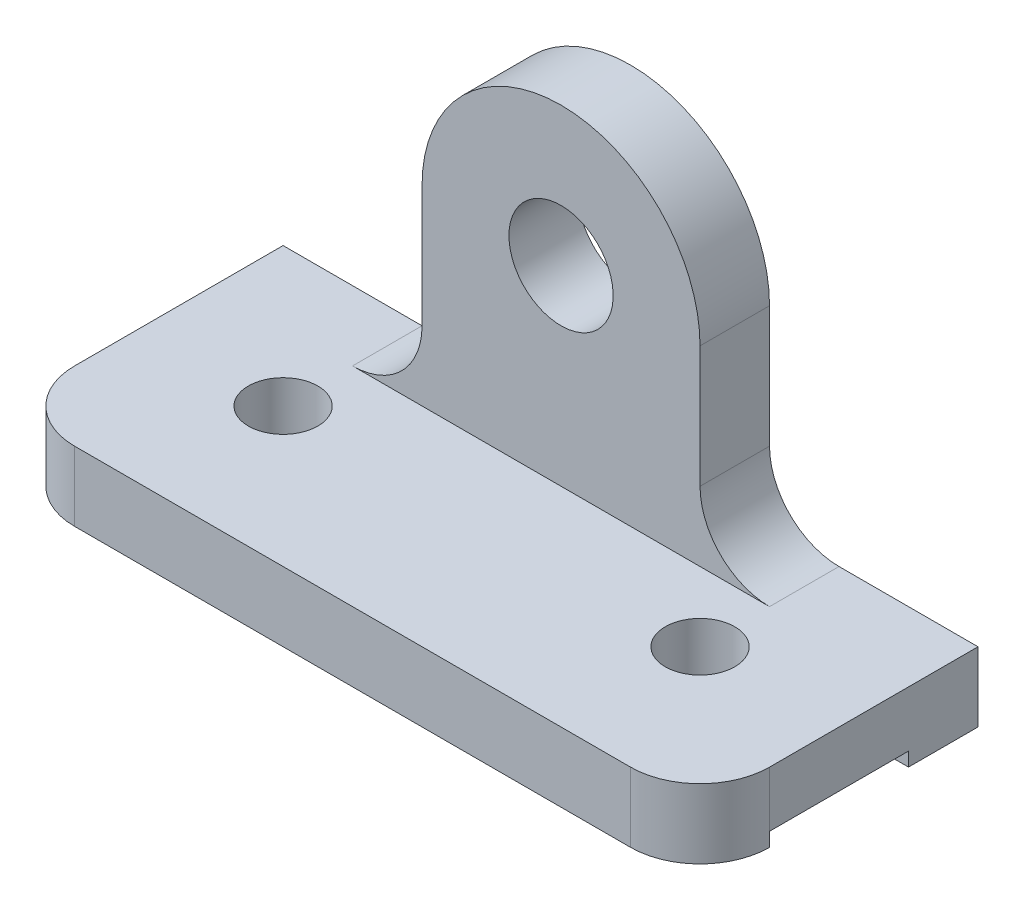
ISO-10303-21;
HEADER;
FILE_DESCRIPTION(('STEP AP214'),'2;1');
FILE_NAME('part.step','',(''),(''),'','','');
FILE_SCHEMA(('AUTOMOTIVE_DESIGN { 1 0 10303 214 1 1 1 1 }'));
ENDSEC;
DATA;
#1=APPLICATION_CONTEXT('core data for automotive mechanical design processes');
#2=APPLICATION_PROTOCOL_DEFINITION('international standard','automotive_design',2000,#1);
#3=PRODUCT_CONTEXT('',#1,'mechanical');
#4=PRODUCT('Part','Part','',(#3));
#5=PRODUCT_RELATED_PRODUCT_CATEGORY('part','',(#4));
#6=PRODUCT_DEFINITION_FORMATION('','',#4);
#7=PRODUCT_DEFINITION_CONTEXT('part definition',#1,'design');
#8=PRODUCT_DEFINITION('design','',#6,#7);
#9=PRODUCT_DEFINITION_SHAPE('','',#8);
#10=(LENGTH_UNIT() NAMED_UNIT(*) SI_UNIT(.MILLI.,.METRE.));
#11=(NAMED_UNIT(*) PLANE_ANGLE_UNIT() SI_UNIT($,.RADIAN.));
#12=(NAMED_UNIT(*) SI_UNIT($,.STERADIAN.) SOLID_ANGLE_UNIT());
#13=UNCERTAINTY_MEASURE_WITH_UNIT(LENGTH_MEASURE(1.E-05),#10,'distance_accuracy_value','');
#14=(GEOMETRIC_REPRESENTATION_CONTEXT(3) GLOBAL_UNCERTAINTY_ASSIGNED_CONTEXT((#13)) GLOBAL_UNIT_ASSIGNED_CONTEXT((#10,
#11,#12)) REPRESENTATION_CONTEXT('',''));
#15=CARTESIAN_POINT('',(0.,0.,0.));
#16=DIRECTION('',(0.,0.,1.));
#17=DIRECTION('',(1.,0.,0.));
#18=AXIS2_PLACEMENT_3D('',#15,#16,#17);
#19=CARTESIAN_POINT('',(100.,5.,20.));
#20=DIRECTION('',(0.,-1.,0.));
#21=DIRECTION('',(0.,0.,-1.));
#22=AXIS2_PLACEMENT_3D('',#19,#20,#21);
#23=PLANE('',#22);
#24=CARTESIAN_POINT('',(20.,5.,0.));
#25=DIRECTION('',(0.,1.,0.));
#26=DIRECTION('',(0.,0.,1.));
#27=AXIS2_PLACEMENT_3D('',#24,#25,#26);
#28=CIRCLE('',#27,5.);
#29=CARTESIAN_POINT('',(20.,5.,5.));
#30=VERTEX_POINT('',#29);
#31=EDGE_CURVE('E200',#30,#30,#28,.T.);
#32=ORIENTED_EDGE('',*,*,#31,.F.);
#33=EDGE_LOOP('',(#32));
#34=FACE_BOUND('',#33,.T.);
#35=CARTESIAN_POINT('',(80.,5.,0.));
#36=DIRECTION('',(0.,1.,0.));
#37=DIRECTION('',(0.,0.,1.));
#38=AXIS2_PLACEMENT_3D('',#35,#36,#37);
#39=CIRCLE('',#38,5.);
#40=CARTESIAN_POINT('',(80.,5.,5.));
#41=VERTEX_POINT('',#40);
#42=EDGE_CURVE('E191',#41,#41,#39,.T.);
#43=ORIENTED_EDGE('',*,*,#42,.F.);
#44=EDGE_LOOP('',(#43));
#45=FACE_BOUND('',#44,.T.);
#46=DIRECTION('',(0.,0.,-1.));
#47=VECTOR('',#46,1.);
#48=CARTESIAN_POINT('',(19.9999999999999,5.,-10.));
#49=LINE('',#48,#47);
#50=CARTESIAN_POINT('',(19.9999999999999,5.,-10.));
#51=VERTEX_POINT('',#50);
#52=CARTESIAN_POINT('',(19.9999999999999,5.,-20.));
#53=VERTEX_POINT('',#52);
#54=EDGE_CURVE('E194',#51,#53,#49,.T.);
#55=ORIENTED_EDGE('',*,*,#54,.T.);
#56=DIRECTION('',(-1.,0.,0.));
#57=VECTOR('',#56,1.);
#58=CARTESIAN_POINT('',(100.,5.,-20.));
#59=LINE('',#58,#57);
#60=CARTESIAN_POINT('',(0.,5.,-20.));
#61=VERTEX_POINT('',#60);
#62=EDGE_CURVE('E252',#53,#61,#59,.T.);
#63=ORIENTED_EDGE('',*,*,#62,.T.);
#64=DIRECTION('',(0.,0.,1.));
#65=VECTOR('',#64,1.);
#66=CARTESIAN_POINT('',(0.,5.,20.));
#67=LINE('',#66,#65);
#68=CARTESIAN_POINT('',(0.,5.,10.));
#69=VERTEX_POINT('',#68);
#70=EDGE_CURVE('E240',#61,#69,#67,.T.);
#71=ORIENTED_EDGE('',*,*,#70,.T.);
#72=CARTESIAN_POINT('',(9.99999999999999,5.,10.));
#73=DIRECTION('',(0.,-1.,0.));
#74=DIRECTION('',(0.,0.,-1.));
#75=AXIS2_PLACEMENT_3D('',#72,#73,#74);
#76=CIRCLE('',#75,10.);
#77=CARTESIAN_POINT('',(9.99999999999999,5.,20.));
#78=VERTEX_POINT('',#77);
#79=EDGE_CURVE('E42',#69,#78,#76,.F.);
#80=ORIENTED_EDGE('',*,*,#79,.T.);
#81=DIRECTION('',(-1.,0.,0.));
#82=VECTOR('',#81,1.);
#83=CARTESIAN_POINT('',(100.,5.,20.));
#84=LINE('',#83,#82);
#85=CARTESIAN_POINT('',(90.,5.,20.));
#86=VERTEX_POINT('',#85);
#87=EDGE_CURVE('E249',#86,#78,#84,.T.);
#88=ORIENTED_EDGE('',*,*,#87,.F.);
#89=CARTESIAN_POINT('',(90.,5.,10.));
#90=DIRECTION('',(0.,-1.,0.));
#91=DIRECTION('',(0.,0.,-1.));
#92=AXIS2_PLACEMENT_3D('',#89,#90,#91);
#93=CIRCLE('',#92,10.);
#94=CARTESIAN_POINT('',(100.,5.,10.));
#95=VERTEX_POINT('',#94);
#96=EDGE_CURVE('E269',#86,#95,#93,.F.);
#97=ORIENTED_EDGE('',*,*,#96,.T.);
#98=DIRECTION('',(0.,0.,1.));
#99=VECTOR('',#98,1.);
#100=CARTESIAN_POINT('',(100.,5.,20.));
#101=LINE('',#100,#99);
#102=CARTESIAN_POINT('',(100.,5.,-20.));
#103=VERTEX_POINT('',#102);
#104=EDGE_CURVE('E231',#103,#95,#101,.T.);
#105=ORIENTED_EDGE('',*,*,#104,.F.);
#106=CARTESIAN_POINT('',(80.0000000000001,5.,-20.));
#107=VERTEX_POINT('',#106);
#108=EDGE_CURVE('E253',#103,#107,#59,.T.);
#109=ORIENTED_EDGE('',*,*,#108,.T.);
#110=DIRECTION('',(0.,0.,-1.));
#111=VECTOR('',#110,1.);
#112=CARTESIAN_POINT('',(80.0000000000001,5.,-10.));
#113=LINE('',#112,#111);
#114=CARTESIAN_POINT('',(80.0000000000001,5.,-10.));
#115=VERTEX_POINT('',#114);
#116=EDGE_CURVE('E50',#115,#107,#113,.T.);
#117=ORIENTED_EDGE('',*,*,#116,.F.);
#118=DIRECTION('',(-1.,0.,0.));
#119=VECTOR('',#118,1.);
#120=CARTESIAN_POINT('',(80.0000000000001,5.,-10.));
#121=LINE('',#120,#119);
#122=EDGE_CURVE('E54',#115,#51,#121,.T.);
#123=ORIENTED_EDGE('',*,*,#122,.T.);
#124=EDGE_LOOP('',(#55,#63,#71,#80,#88,#97,#105,#109,#117,#123));
#125=FACE_BOUND('',#124,.T.);
#126=ADVANCED_FACE('F33',(#34,#45,#125),#23,.F.);
#127=CARTESIAN_POINT('',(100.,-5.,20.));
#128=DIRECTION('',(0.,1.,0.));
#129=DIRECTION('',(0.,0.,1.));
#130=AXIS2_PLACEMENT_3D('',#127,#128,#129);
#131=PLANE('',#130);
#132=CARTESIAN_POINT('',(9.99999999999999,-5.,10.));
#133=DIRECTION('',(0.,1.,0.));
#134=DIRECTION('',(0.,0.,1.));
#135=AXIS2_PLACEMENT_3D('',#132,#133,#134);
#136=CIRCLE('',#135,10.);
#137=CARTESIAN_POINT('',(9.99999999999999,-5.,20.));
#138=VERTEX_POINT('',#137);
#139=CARTESIAN_POINT('',(0.,-5.,10.));
#140=VERTEX_POINT('',#139);
#141=EDGE_CURVE('E262',#138,#140,#136,.F.);
#142=ORIENTED_EDGE('',*,*,#141,.T.);
#143=DIRECTION('',(1.,0.,0.));
#144=VECTOR('',#143,1.);
#145=CARTESIAN_POINT('',(0.,-5.,10.));
#146=LINE('',#145,#144);
#147=CARTESIAN_POINT('',(100.,-5.,10.));
#148=VERTEX_POINT('',#147);
#149=EDGE_CURVE('E218',#140,#148,#146,.T.);
#150=ORIENTED_EDGE('',*,*,#149,.T.);
#151=CARTESIAN_POINT('',(90.,-5.,10.));
#152=DIRECTION('',(0.,1.,0.));
#153=DIRECTION('',(0.,0.,1.));
#154=AXIS2_PLACEMENT_3D('',#151,#152,#153);
#155=CIRCLE('',#154,10.);
#156=CARTESIAN_POINT('',(90.,-5.,20.));
#157=VERTEX_POINT('',#156);
#158=EDGE_CURVE('E260',#148,#157,#155,.F.);
#159=ORIENTED_EDGE('',*,*,#158,.T.);
#160=DIRECTION('',(-1.,0.,0.));
#161=VECTOR('',#160,1.);
#162=CARTESIAN_POINT('',(100.,-5.,20.));
#163=LINE('',#162,#161);
#164=EDGE_CURVE('E246',#157,#138,#163,.T.);
#165=ORIENTED_EDGE('',*,*,#164,.T.);
#166=EDGE_LOOP('',(#142,#150,#159,#165));
#167=FACE_BOUND('',#166,.T.);
#168=ADVANCED_FACE('F293',(#167),#131,.F.);
#169=CARTESIAN_POINT('',(100.,5.,-20.));
#170=DIRECTION('',(0.,0.,1.));
#171=DIRECTION('',(1.,0.,0.));
#172=AXIS2_PLACEMENT_3D('',#169,#170,#171);
#173=PLANE('',#172);
#174=DIRECTION('',(0.,1.,0.));
#175=VECTOR('',#174,1.);
#176=CARTESIAN_POINT('',(0.,5.,-20.));
#177=LINE('',#176,#175);
#178=CARTESIAN_POINT('',(0.,-5.,-20.));
#179=VERTEX_POINT('',#178);
#180=EDGE_CURVE('E221',#179,#61,#177,.T.);
#181=ORIENTED_EDGE('',*,*,#180,.T.);
#182=ORIENTED_EDGE('',*,*,#62,.F.);
#183=CARTESIAN_POINT('',(20.,15.,-20.));
#184=DIRECTION('',(0.,0.,1.));
#185=DIRECTION('',(1.,0.,0.));
#186=AXIS2_PLACEMENT_3D('',#183,#184,#185);
#187=CIRCLE('',#186,10.);
#188=CARTESIAN_POINT('',(30.,15.0000000000001,-20.));
#189=VERTEX_POINT('',#188);
#190=EDGE_CURVE('E169',#53,#189,#187,.T.);
#191=ORIENTED_EDGE('',*,*,#190,.T.);
#192=DIRECTION('',(0.,1.,0.));
#193=VECTOR('',#192,1.);
#194=CARTESIAN_POINT('',(30.,32.5,-20.));
#195=LINE('',#194,#193);
#196=CARTESIAN_POINT('',(30.,32.5,-20.));
#197=VERTEX_POINT('',#196);
#198=EDGE_CURVE('E166',#189,#197,#195,.T.);
#199=ORIENTED_EDGE('',*,*,#198,.T.);
#200=CARTESIAN_POINT('',(50.,32.5,-20.));
#201=DIRECTION('',(0.,0.,-1.));
#202=DIRECTION('',(-1.,0.,0.));
#203=AXIS2_PLACEMENT_3D('',#200,#201,#202);
#204=CIRCLE('',#203,20.);
#205=CARTESIAN_POINT('',(70.,32.5,-20.));
#206=VERTEX_POINT('',#205);
#207=EDGE_CURVE('E181',#197,#206,#204,.T.);
#208=ORIENTED_EDGE('',*,*,#207,.T.);
#209=DIRECTION('',(0.,-1.,0.));
#210=VECTOR('',#209,1.);
#211=CARTESIAN_POINT('',(70.,32.5,-20.));
#212=LINE('',#211,#210);
#213=CARTESIAN_POINT('',(70.,15.0000000000001,-20.));
#214=VERTEX_POINT('',#213);
#215=EDGE_CURVE('E146',#206,#214,#212,.T.);
#216=ORIENTED_EDGE('',*,*,#215,.T.);
#217=CARTESIAN_POINT('',(80.,15.,-20.));
#218=DIRECTION('',(0.,0.,1.));
#219=DIRECTION('',(-1.,0.,0.));
#220=AXIS2_PLACEMENT_3D('',#217,#218,#219);
#221=CIRCLE('',#220,10.);
#222=EDGE_CURVE('E185',#214,#107,#221,.T.);
#223=ORIENTED_EDGE('',*,*,#222,.T.);
#224=ORIENTED_EDGE('',*,*,#108,.F.);
#225=DIRECTION('',(0.,1.,0.));
#226=VECTOR('',#225,1.);
#227=CARTESIAN_POINT('',(100.,5.,-20.));
#228=LINE('',#227,#226);
#229=CARTESIAN_POINT('',(100.,-5.,-20.));
#230=VERTEX_POINT('',#229);
#231=EDGE_CURVE('E228',#230,#103,#228,.T.);
#232=ORIENTED_EDGE('',*,*,#231,.F.);
#233=DIRECTION('',(-1.,0.,0.));
#234=VECTOR('',#233,1.);
#235=CARTESIAN_POINT('',(100.,-5.,-20.));
#236=LINE('',#235,#234);
#237=EDGE_CURVE('E237',#230,#179,#236,.T.);
#238=ORIENTED_EDGE('',*,*,#237,.T.);
#239=EDGE_LOOP('',(#181,#182,#191,#199,#208,#216,#223,#224,#232,#238));
#240=FACE_BOUND('',#239,.T.);
#241=CARTESIAN_POINT('',(50.,32.5,-20.));
#242=DIRECTION('',(0.,0.,-1.));
#243=DIRECTION('',(-1.,0.,0.));
#244=AXIS2_PLACEMENT_3D('',#241,#242,#243);
#245=CIRCLE('',#244,7.5);
#246=CARTESIAN_POINT('',(42.5,32.5,-20.));
#247=VERTEX_POINT('',#246);
#248=EDGE_CURVE('E172',#247,#247,#245,.T.);
#249=ORIENTED_EDGE('',*,*,#248,.F.);
#250=EDGE_LOOP('',(#249));
#251=FACE_BOUND('',#250,.T.);
#252=ADVANCED_FACE('F299',(#240,#251),#173,.F.);
#253=CARTESIAN_POINT('',(100.,5.,20.));
#254=DIRECTION('',(0.,0.,-1.));
#255=DIRECTION('',(-1.,0.,0.));
#256=AXIS2_PLACEMENT_3D('',#253,#254,#255);
#257=PLANE('',#256);
#258=ORIENTED_EDGE('',*,*,#87,.T.);
#259=DIRECTION('',(0.,-1.,0.));
#260=VECTOR('',#259,1.);
#261=CARTESIAN_POINT('',(9.99999999999999,5.,20.));
#262=LINE('',#261,#260);
#263=EDGE_CURVE('E257',#78,#138,#262,.T.);
#264=ORIENTED_EDGE('',*,*,#263,.T.);
#265=ORIENTED_EDGE('',*,*,#164,.F.);
#266=DIRECTION('',(0.,-1.,0.));
#267=VECTOR('',#266,1.);
#268=CARTESIAN_POINT('',(90.,5.,20.));
#269=LINE('',#268,#267);
#270=EDGE_CURVE('E255',#157,#86,#269,.F.);
#271=ORIENTED_EDGE('',*,*,#270,.T.);
#272=EDGE_LOOP('',(#258,#264,#265,#271));
#273=FACE_BOUND('',#272,.T.);
#274=ADVANCED_FACE('F307',(#273),#257,.F.);
#275=DIRECTION('',(0.,0.,-1.));
#276=VECTOR('',#275,1.);
#277=CARTESIAN_POINT('',(100.,-5.,20.));
#278=LINE('',#277,#276);
#279=CARTESIAN_POINT('',(100.,-5.,-10.));
#280=VERTEX_POINT('',#279);
#281=EDGE_CURVE('E235',#280,#230,#278,.T.);
#282=ORIENTED_EDGE('',*,*,#281,.F.);
#283=DIRECTION('',(1.,0.,0.));
#284=VECTOR('',#283,1.);
#285=CARTESIAN_POINT('',(0.,-5.,-10.));
#286=LINE('',#285,#284);
#287=CARTESIAN_POINT('',(0.,-5.,-10.));
#288=VERTEX_POINT('',#287);
#289=EDGE_CURVE('E211',#288,#280,#286,.T.);
#290=ORIENTED_EDGE('',*,*,#289,.F.);
#291=DIRECTION('',(0.,0.,-1.));
#292=VECTOR('',#291,1.);
#293=CARTESIAN_POINT('',(0.,-5.,20.));
#294=LINE('',#293,#292);
#295=EDGE_CURVE('E232',#288,#179,#294,.T.);
#296=ORIENTED_EDGE('',*,*,#295,.T.);
#297=ORIENTED_EDGE('',*,*,#237,.F.);
#298=EDGE_LOOP('',(#282,#290,#296,#297));
#299=FACE_BOUND('',#298,.T.);
#300=ADVANCED_FACE('F302',(#299),#131,.F.);
#301=CARTESIAN_POINT('',(100.,0.,0.));
#302=DIRECTION('',(1.,0.,0.));
#303=DIRECTION('',(0.,0.,-1.));
#304=AXIS2_PLACEMENT_3D('',#301,#302,#303);
#305=PLANE('',#304);
#306=DIRECTION('',(0.,0.,1.));
#307=VECTOR('',#306,1.);
#308=CARTESIAN_POINT('',(100.,-3.,-10.));
#309=LINE('',#308,#307);
#310=CARTESIAN_POINT('',(100.,-3.,-10.));
#311=VERTEX_POINT('',#310);
#312=CARTESIAN_POINT('',(100.,-3.,10.));
#313=VERTEX_POINT('',#312);
#314=EDGE_CURVE('E215',#311,#313,#309,.T.);
#315=ORIENTED_EDGE('',*,*,#314,.F.);
#316=DIRECTION('',(0.,1.,0.));
#317=VECTOR('',#316,1.);
#318=CARTESIAN_POINT('',(100.,-5.,-10.));
#319=LINE('',#318,#317);
#320=EDGE_CURVE('E212',#280,#311,#319,.T.);
#321=ORIENTED_EDGE('',*,*,#320,.F.);
#322=ORIENTED_EDGE('',*,*,#281,.T.);
#323=ORIENTED_EDGE('',*,*,#231,.T.);
#324=ORIENTED_EDGE('',*,*,#104,.T.);
#325=DIRECTION('',(0.,-1.,0.));
#326=VECTOR('',#325,1.);
#327=CARTESIAN_POINT('',(100.,-5.,10.));
#328=LINE('',#327,#326);
#329=EDGE_CURVE('E11',#95,#313,#328,.T.);
#330=ORIENTED_EDGE('',*,*,#329,.T.);
#331=EDGE_LOOP('',(#315,#321,#322,#323,#324,#330));
#332=FACE_BOUND('',#331,.T.);
#333=ADVANCED_FACE('F320',(#332),#305,.T.);
#334=CARTESIAN_POINT('',(0.,0.,0.));
#335=DIRECTION('',(1.,0.,0.));
#336=DIRECTION('',(0.,0.,-1.));
#337=AXIS2_PLACEMENT_3D('',#334,#335,#336);
#338=PLANE('',#337);
#339=DIRECTION('',(0.,1.,0.));
#340=VECTOR('',#339,1.);
#341=CARTESIAN_POINT('',(0.,-5.,-10.));
#342=LINE('',#341,#340);
#343=CARTESIAN_POINT('',(0.,-3.,-10.));
#344=VERTEX_POINT('',#343);
#345=EDGE_CURVE('E204',#288,#344,#342,.T.);
#346=ORIENTED_EDGE('',*,*,#345,.T.);
#347=DIRECTION('',(0.,0.,1.));
#348=VECTOR('',#347,1.);
#349=CARTESIAN_POINT('',(0.,-3.,-10.));
#350=LINE('',#349,#348);
#351=CARTESIAN_POINT('',(0.,-3.,10.));
#352=VERTEX_POINT('',#351);
#353=EDGE_CURVE('E207',#344,#352,#350,.T.);
#354=ORIENTED_EDGE('',*,*,#353,.T.);
#355=DIRECTION('',(0.,-1.,0.));
#356=VECTOR('',#355,1.);
#357=CARTESIAN_POINT('',(0.,0.,10.));
#358=LINE('',#357,#356);
#359=EDGE_CURVE('E265',#352,#69,#358,.F.);
#360=ORIENTED_EDGE('',*,*,#359,.T.);
#361=ORIENTED_EDGE('',*,*,#70,.F.);
#362=ORIENTED_EDGE('',*,*,#180,.F.);
#363=ORIENTED_EDGE('',*,*,#295,.F.);
#364=EDGE_LOOP('',(#346,#354,#360,#361,#362,#363));
#365=FACE_BOUND('',#364,.T.);
#366=ADVANCED_FACE('F312',(#365),#338,.F.);
#367=CARTESIAN_POINT('',(9.99999999999999,5.,10.));
#368=DIRECTION('',(0.,-1.,0.));
#369=DIRECTION('',(0.,0.,-1.));
#370=AXIS2_PLACEMENT_3D('',#367,#368,#369);
#371=CYLINDRICAL_SURFACE('',#370,10.);
#372=ORIENTED_EDGE('',*,*,#79,.F.);
#373=ORIENTED_EDGE('',*,*,#359,.F.);
#374=EDGE_CURVE('E266',#140,#352,#358,.F.);
#375=ORIENTED_EDGE('',*,*,#374,.F.);
#376=ORIENTED_EDGE('',*,*,#141,.F.);
#377=ORIENTED_EDGE('',*,*,#263,.F.);
#378=EDGE_LOOP('',(#372,#373,#375,#376,#377));
#379=FACE_BOUND('',#378,.T.);
#380=ADVANCED_FACE('F310',(#379),#371,.T.);
#381=CARTESIAN_POINT('',(90.,0.,10.));
#382=DIRECTION('',(0.,1.,0.));
#383=DIRECTION('',(0.,0.,1.));
#384=AXIS2_PLACEMENT_3D('',#381,#382,#383);
#385=CYLINDRICAL_SURFACE('',#384,10.);
#386=ORIENTED_EDGE('',*,*,#96,.F.);
#387=ORIENTED_EDGE('',*,*,#270,.F.);
#388=ORIENTED_EDGE('',*,*,#158,.F.);
#389=DIRECTION('',(0.,-1.,0.));
#390=VECTOR('',#389,1.);
#391=CARTESIAN_POINT('',(100.,-3.,10.));
#392=LINE('',#391,#390);
#393=EDGE_CURVE('E208',#313,#148,#392,.T.);
#394=ORIENTED_EDGE('',*,*,#393,.F.);
#395=ORIENTED_EDGE('',*,*,#329,.F.);
#396=EDGE_LOOP('',(#386,#387,#388,#394,#395));
#397=FACE_BOUND('',#396,.T.);
#398=ADVANCED_FACE('F35',(#397),#385,.T.);
#399=CARTESIAN_POINT('',(0.,-3.,10.));
#400=DIRECTION('',(0.,0.,1.));
#401=DIRECTION('',(1.,0.,0.));
#402=AXIS2_PLACEMENT_3D('',#399,#400,#401);
#403=PLANE('',#402);
#404=ORIENTED_EDGE('',*,*,#393,.T.);
#405=ORIENTED_EDGE('',*,*,#149,.F.);
#406=ORIENTED_EDGE('',*,*,#374,.T.);
#407=DIRECTION('',(1.,0.,0.));
#408=VECTOR('',#407,1.);
#409=CARTESIAN_POINT('',(0.,-3.,10.));
#410=LINE('',#409,#408);
#411=EDGE_CURVE('E222',#352,#313,#410,.T.);
#412=ORIENTED_EDGE('',*,*,#411,.T.);
#413=EDGE_LOOP('',(#404,#405,#406,#412));
#414=FACE_BOUND('',#413,.T.);
#415=ADVANCED_FACE('F318',(#414),#403,.F.);
#416=CARTESIAN_POINT('',(0.,-3.,-10.));
#417=DIRECTION('',(0.,1.,0.));
#418=DIRECTION('',(0.,0.,1.));
#419=AXIS2_PLACEMENT_3D('',#416,#417,#418);
#420=PLANE('',#419);
#421=CARTESIAN_POINT('',(80.,-3.,0.));
#422=DIRECTION('',(0.,1.,0.));
#423=DIRECTION('',(0.,0.,1.));
#424=AXIS2_PLACEMENT_3D('',#421,#422,#423);
#425=CIRCLE('',#424,5.);
#426=CARTESIAN_POINT('',(80.,-3.,5.));
#427=VERTEX_POINT('',#426);
#428=EDGE_CURVE('E37',#427,#427,#425,.T.);
#429=ORIENTED_EDGE('',*,*,#428,.T.);
#430=EDGE_LOOP('',(#429));
#431=FACE_BOUND('',#430,.T.);
#432=CARTESIAN_POINT('',(20.,-3.,0.));
#433=DIRECTION('',(0.,1.,0.));
#434=DIRECTION('',(0.,0.,1.));
#435=AXIS2_PLACEMENT_3D('',#432,#433,#434);
#436=CIRCLE('',#435,5.);
#437=CARTESIAN_POINT('',(20.,-3.,5.));
#438=VERTEX_POINT('',#437);
#439=EDGE_CURVE('E203',#438,#438,#436,.T.);
#440=ORIENTED_EDGE('',*,*,#439,.T.);
#441=EDGE_LOOP('',(#440));
#442=FACE_BOUND('',#441,.T.);
#443=ORIENTED_EDGE('',*,*,#314,.T.);
#444=ORIENTED_EDGE('',*,*,#411,.F.);
#445=ORIENTED_EDGE('',*,*,#353,.F.);
#446=DIRECTION('',(1.,0.,0.));
#447=VECTOR('',#446,1.);
#448=CARTESIAN_POINT('',(0.,-3.,-10.));
#449=LINE('',#448,#447);
#450=EDGE_CURVE('E225',#344,#311,#449,.T.);
#451=ORIENTED_EDGE('',*,*,#450,.T.);
#452=EDGE_LOOP('',(#443,#444,#445,#451));
#453=FACE_BOUND('',#452,.T.);
#454=ADVANCED_FACE('F274',(#431,#442,#453),#420,.F.);
#455=CARTESIAN_POINT('',(0.,-5.,-10.));
#456=DIRECTION('',(0.,0.,-1.));
#457=DIRECTION('',(0.,1.,0.));
#458=AXIS2_PLACEMENT_3D('',#455,#456,#457);
#459=PLANE('',#458);
#460=ORIENTED_EDGE('',*,*,#320,.T.);
#461=ORIENTED_EDGE('',*,*,#450,.F.);
#462=ORIENTED_EDGE('',*,*,#345,.F.);
#463=ORIENTED_EDGE('',*,*,#289,.T.);
#464=EDGE_LOOP('',(#460,#461,#462,#463));
#465=FACE_BOUND('',#464,.T.);
#466=ADVANCED_FACE('F280',(#465),#459,.F.);
#467=CARTESIAN_POINT('',(20.,-5.,0.));
#468=DIRECTION('',(0.,1.,0.));
#469=DIRECTION('',(0.,0.,1.));
#470=AXIS2_PLACEMENT_3D('',#467,#468,#469);
#471=CYLINDRICAL_SURFACE('',#470,5.);
#472=ORIENTED_EDGE('',*,*,#31,.T.);
#473=EDGE_LOOP('',(#472));
#474=FACE_BOUND('',#473,.T.);
#475=ORIENTED_EDGE('',*,*,#439,.F.);
#476=EDGE_LOOP('',(#475));
#477=FACE_BOUND('',#476,.T.);
#478=ADVANCED_FACE('F277',(#474,#477),#471,.F.);
#479=CARTESIAN_POINT('',(80.,-5.,0.));
#480=DIRECTION('',(0.,1.,0.));
#481=DIRECTION('',(0.,0.,1.));
#482=AXIS2_PLACEMENT_3D('',#479,#480,#481);
#483=CYLINDRICAL_SURFACE('',#482,5.);
#484=ORIENTED_EDGE('',*,*,#42,.T.);
#485=EDGE_LOOP('',(#484));
#486=FACE_BOUND('',#485,.T.);
#487=ORIENTED_EDGE('',*,*,#428,.F.);
#488=EDGE_LOOP('',(#487));
#489=FACE_BOUND('',#488,.T.);
#490=ADVANCED_FACE('F279',(#486,#489),#483,.F.);
#491=CARTESIAN_POINT('',(50.,32.5,-10.));
#492=DIRECTION('',(0.,0.,-1.));
#493=DIRECTION('',(-1.,0.,0.));
#494=AXIS2_PLACEMENT_3D('',#491,#492,#493);
#495=CYLINDRICAL_SURFACE('',#494,20.);
#496=ORIENTED_EDGE('',*,*,#207,.F.);
#497=DIRECTION('',(0.,0.,-1.));
#498=VECTOR('',#497,1.);
#499=CARTESIAN_POINT('',(30.,32.5,-10.));
#500=LINE('',#499,#498);
#501=CARTESIAN_POINT('',(30.,32.5,-10.));
#502=VERTEX_POINT('',#501);
#503=EDGE_CURVE('E165',#502,#197,#500,.T.);
#504=ORIENTED_EDGE('',*,*,#503,.F.);
#505=CARTESIAN_POINT('',(50.,32.5,-10.));
#506=DIRECTION('',(0.,0.,-1.));
#507=DIRECTION('',(-1.,0.,0.));
#508=AXIS2_PLACEMENT_3D('',#505,#506,#507);
#509=CIRCLE('',#508,20.);
#510=CARTESIAN_POINT('',(70.,32.5,-10.));
#511=VERTEX_POINT('',#510);
#512=EDGE_CURVE('E159',#502,#511,#509,.T.);
#513=ORIENTED_EDGE('',*,*,#512,.T.);
#514=DIRECTION('',(0.,0.,-1.));
#515=VECTOR('',#514,1.);
#516=CARTESIAN_POINT('',(70.,32.5,-10.));
#517=LINE('',#516,#515);
#518=EDGE_CURVE('E141',#511,#206,#517,.T.);
#519=ORIENTED_EDGE('',*,*,#518,.T.);
#520=EDGE_LOOP('',(#496,#504,#513,#519));
#521=FACE_BOUND('',#520,.T.);
#522=ADVANCED_FACE('F164',(#521),#495,.T.);
#523=CARTESIAN_POINT('',(30.,32.5,-10.));
#524=DIRECTION('',(-1.,0.,0.));
#525=DIRECTION('',(0.,0.,1.));
#526=AXIS2_PLACEMENT_3D('',#523,#524,#525);
#527=PLANE('',#526);
#528=ORIENTED_EDGE('',*,*,#198,.F.);
#529=DIRECTION('',(0.,0.,-1.));
#530=VECTOR('',#529,1.);
#531=CARTESIAN_POINT('',(30.,15.0000000000001,-10.));
#532=LINE('',#531,#530);
#533=CARTESIAN_POINT('',(30.,15.0000000000001,-10.));
#534=VERTEX_POINT('',#533);
#535=EDGE_CURVE('E192',#534,#189,#532,.T.);
#536=ORIENTED_EDGE('',*,*,#535,.F.);
#537=DIRECTION('',(0.,1.,0.));
#538=VECTOR('',#537,1.);
#539=CARTESIAN_POINT('',(30.,32.5,-10.));
#540=LINE('',#539,#538);
#541=EDGE_CURVE('E152',#534,#502,#540,.T.);
#542=ORIENTED_EDGE('',*,*,#541,.T.);
#543=ORIENTED_EDGE('',*,*,#503,.T.);
#544=EDGE_LOOP('',(#528,#536,#542,#543));
#545=FACE_BOUND('',#544,.T.);
#546=ADVANCED_FACE('F350',(#545),#527,.T.);
#547=CARTESIAN_POINT('',(20.,15.,-10.));
#548=DIRECTION('',(0.,0.,-1.));
#549=DIRECTION('',(-1.,0.,0.));
#550=AXIS2_PLACEMENT_3D('',#547,#548,#549);
#551=CYLINDRICAL_SURFACE('',#550,10.);
#552=ORIENTED_EDGE('',*,*,#190,.F.);
#553=ORIENTED_EDGE('',*,*,#54,.F.);
#554=CARTESIAN_POINT('',(20.,15.,-10.));
#555=DIRECTION('',(0.,0.,1.));
#556=DIRECTION('',(1.,0.,0.));
#557=AXIS2_PLACEMENT_3D('',#554,#555,#556);
#558=CIRCLE('',#557,10.);
#559=EDGE_CURVE('E177',#51,#534,#558,.T.);
#560=ORIENTED_EDGE('',*,*,#559,.T.);
#561=ORIENTED_EDGE('',*,*,#535,.T.);
#562=EDGE_LOOP('',(#552,#553,#560,#561));
#563=FACE_BOUND('',#562,.T.);
#564=ADVANCED_FACE('F353',(#563),#551,.F.);
#565=CARTESIAN_POINT('',(80.,15.,-10.));
#566=DIRECTION('',(0.,0.,-1.));
#567=DIRECTION('',(-1.,0.,0.));
#568=AXIS2_PLACEMENT_3D('',#565,#566,#567);
#569=CYLINDRICAL_SURFACE('',#568,10.);
#570=ORIENTED_EDGE('',*,*,#222,.F.);
#571=DIRECTION('',(0.,0.,-1.));
#572=VECTOR('',#571,1.);
#573=CARTESIAN_POINT('',(70.,15.0000000000001,-10.));
#574=LINE('',#573,#572);
#575=CARTESIAN_POINT('',(70.,15.0000000000001,-10.));
#576=VERTEX_POINT('',#575);
#577=EDGE_CURVE('E151',#576,#214,#574,.T.);
#578=ORIENTED_EDGE('',*,*,#577,.F.);
#579=CARTESIAN_POINT('',(80.,15.,-10.));
#580=DIRECTION('',(0.,0.,1.));
#581=DIRECTION('',(-1.,0.,0.));
#582=AXIS2_PLACEMENT_3D('',#579,#580,#581);
#583=CIRCLE('',#582,10.);
#584=EDGE_CURVE('E162',#576,#115,#583,.T.);
#585=ORIENTED_EDGE('',*,*,#584,.T.);
#586=ORIENTED_EDGE('',*,*,#116,.T.);
#587=EDGE_LOOP('',(#570,#578,#585,#586));
#588=FACE_BOUND('',#587,.T.);
#589=ADVANCED_FACE('F346',(#588),#569,.F.);
#590=CARTESIAN_POINT('',(70.,32.5,-10.));
#591=DIRECTION('',(1.,0.,0.));
#592=DIRECTION('',(0.,0.,-1.));
#593=AXIS2_PLACEMENT_3D('',#590,#591,#592);
#594=PLANE('',#593);
#595=ORIENTED_EDGE('',*,*,#215,.F.);
#596=ORIENTED_EDGE('',*,*,#518,.F.);
#597=DIRECTION('',(0.,-1.,0.));
#598=VECTOR('',#597,1.);
#599=CARTESIAN_POINT('',(70.,32.5,-10.));
#600=LINE('',#599,#598);
#601=EDGE_CURVE('E144',#511,#576,#600,.T.);
#602=ORIENTED_EDGE('',*,*,#601,.T.);
#603=ORIENTED_EDGE('',*,*,#577,.T.);
#604=EDGE_LOOP('',(#595,#596,#602,#603));
#605=FACE_BOUND('',#604,.T.);
#606=ADVANCED_FACE('F143',(#605),#594,.T.);
#607=CARTESIAN_POINT('',(50.,32.5,-10.));
#608=DIRECTION('',(0.,0.,-1.));
#609=DIRECTION('',(-1.,0.,0.));
#610=AXIS2_PLACEMENT_3D('',#607,#608,#609);
#611=PLANE('',#610);
#612=CARTESIAN_POINT('',(50.,32.5,-10.));
#613=DIRECTION('',(0.,0.,-1.));
#614=DIRECTION('',(-1.,0.,0.));
#615=AXIS2_PLACEMENT_3D('',#612,#613,#614);
#616=CIRCLE('',#615,7.5);
#617=CARTESIAN_POINT('',(42.5,32.5,-10.));
#618=VERTEX_POINT('',#617);
#619=EDGE_CURVE('E183',#618,#618,#616,.T.);
#620=ORIENTED_EDGE('',*,*,#619,.T.);
#621=EDGE_LOOP('',(#620));
#622=FACE_BOUND('',#621,.T.);
#623=ORIENTED_EDGE('',*,*,#512,.F.);
#624=ORIENTED_EDGE('',*,*,#541,.F.);
#625=ORIENTED_EDGE('',*,*,#559,.F.);
#626=ORIENTED_EDGE('',*,*,#122,.F.);
#627=ORIENTED_EDGE('',*,*,#584,.F.);
#628=ORIENTED_EDGE('',*,*,#601,.F.);
#629=EDGE_LOOP('',(#623,#624,#625,#626,#627,#628));
#630=FACE_BOUND('',#629,.T.);
#631=ADVANCED_FACE('F157',(#622,#630),#611,.F.);
#632=CARTESIAN_POINT('',(50.,32.5,-10.));
#633=DIRECTION('',(0.,0.,-1.));
#634=DIRECTION('',(-1.,0.,0.));
#635=AXIS2_PLACEMENT_3D('',#632,#633,#634);
#636=CYLINDRICAL_SURFACE('',#635,7.5);
#637=ORIENTED_EDGE('',*,*,#619,.F.);
#638=EDGE_LOOP('',(#637));
#639=FACE_BOUND('',#638,.T.);
#640=ORIENTED_EDGE('',*,*,#248,.T.);
#641=EDGE_LOOP('',(#640));
#642=FACE_BOUND('',#641,.T.);
#643=ADVANCED_FACE('F488',(#639,#642),#636,.F.);
#644=CLOSED_SHELL('',(#126,#168,#252,#274,#300,#333,#366,#380,#398,#415,#454,#466,#478,#490,
#522,#546,#564,#589,#606,#631,#643));
#645=MANIFOLD_SOLID_BREP('B2',#644);
#646=ADVANCED_BREP_SHAPE_REPRESENTATION('',(#18,#645),#14);
#647=SHAPE_DEFINITION_REPRESENTATION(#9,#646);
ENDSEC;
END-ISO-10303-21;
